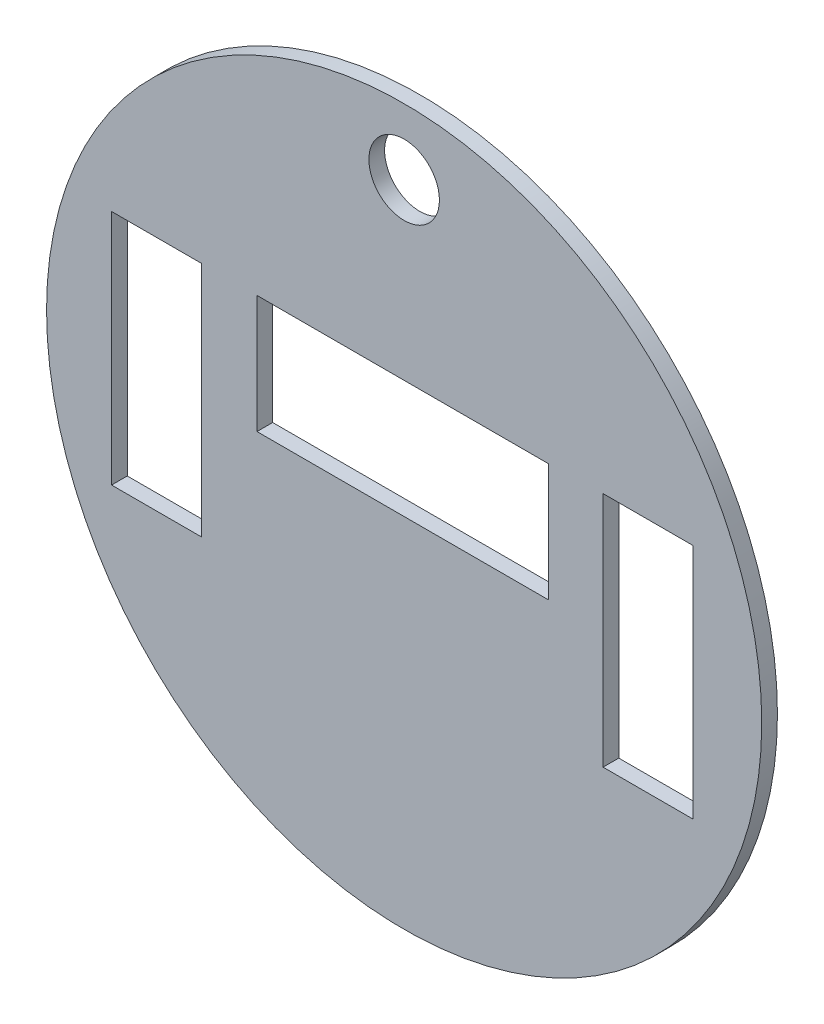
ISO-10303-21;
HEADER;
FILE_DESCRIPTION(('STEP AP214'),'2;1');
FILE_NAME('part.step','',(''),(''),'','','');
FILE_SCHEMA(('AUTOMOTIVE_DESIGN { 1 0 10303 214 1 1 1 1 }'));
ENDSEC;
DATA;
#1=APPLICATION_CONTEXT('core data for automotive mechanical design processes');
#2=APPLICATION_PROTOCOL_DEFINITION('international standard','automotive_design',2000,#1);
#3=PRODUCT_CONTEXT('',#1,'mechanical');
#4=PRODUCT('Part','Part','',(#3));
#5=PRODUCT_RELATED_PRODUCT_CATEGORY('part','',(#4));
#6=PRODUCT_DEFINITION_FORMATION('','',#4);
#7=PRODUCT_DEFINITION_CONTEXT('part definition',#1,'design');
#8=PRODUCT_DEFINITION('design','',#6,#7);
#9=PRODUCT_DEFINITION_SHAPE('','',#8);
#10=(LENGTH_UNIT() NAMED_UNIT(*) SI_UNIT(.MILLI.,.METRE.));
#11=(NAMED_UNIT(*) PLANE_ANGLE_UNIT() SI_UNIT($,.RADIAN.));
#12=(NAMED_UNIT(*) SI_UNIT($,.STERADIAN.) SOLID_ANGLE_UNIT());
#13=UNCERTAINTY_MEASURE_WITH_UNIT(LENGTH_MEASURE(1.E-05),#10,'distance_accuracy_value','');
#14=(GEOMETRIC_REPRESENTATION_CONTEXT(3) GLOBAL_UNCERTAINTY_ASSIGNED_CONTEXT((#13)) GLOBAL_UNIT_ASSIGNED_CONTEXT((#10,
#11,#12)) REPRESENTATION_CONTEXT('',''));
#15=CARTESIAN_POINT('',(0.,0.,0.));
#16=DIRECTION('',(0.,0.,1.));
#17=DIRECTION('',(1.,0.,0.));
#18=AXIS2_PLACEMENT_3D('',#15,#16,#17);
#19=CARTESIAN_POINT('',(0.,0.,13.716));
#20=DIRECTION('',(0.,0.,1.));
#21=DIRECTION('',(1.,0.,0.));
#22=AXIS2_PLACEMENT_3D('',#19,#20,#21);
#23=PLANE('',#22);
#24=DIRECTION('',(1.,0.,0.));
#25=VECTOR('',#24,1.);
#26=CARTESIAN_POINT('',(-128.606579548034,0.,13.716));
#27=LINE('',#26,#25);
#28=CARTESIAN_POINT('',(-128.606579548034,0.,13.716));
#29=VERTEX_POINT('',#28);
#30=CARTESIAN_POINT('',(126.181319760796,0.,13.716));
#31=VERTEX_POINT('',#30);
#32=EDGE_CURVE('E133',#29,#31,#27,.T.);
#33=ORIENTED_EDGE('',*,*,#32,.F.);
#34=DIRECTION('',(0.,-1.,0.));
#35=VECTOR('',#34,1.);
#36=CARTESIAN_POINT('',(-128.606579548034,103.031623715212,13.716));
#37=LINE('',#36,#35);
#38=CARTESIAN_POINT('',(-128.606579548034,103.031623715212,13.716));
#39=VERTEX_POINT('',#38);
#40=EDGE_CURVE('E125',#39,#29,#37,.T.);
#41=ORIENTED_EDGE('',*,*,#40,.F.);
#42=DIRECTION('',(-1.,0.,0.));
#43=VECTOR('',#42,1.);
#44=CARTESIAN_POINT('',(-128.606579548034,103.031623715212,13.716));
#45=LINE('',#44,#43);
#46=CARTESIAN_POINT('',(126.181319760796,103.031623715212,13.716));
#47=VERTEX_POINT('',#46);
#48=EDGE_CURVE('E148',#47,#39,#45,.T.);
#49=ORIENTED_EDGE('',*,*,#48,.F.);
#50=DIRECTION('',(0.,1.,0.));
#51=VECTOR('',#50,1.);
#52=CARTESIAN_POINT('',(126.181319760796,103.031623715212,13.716));
#53=LINE('',#52,#51);
#54=EDGE_CURVE('E146',#31,#47,#53,.T.);
#55=ORIENTED_EDGE('',*,*,#54,.F.);
#56=EDGE_LOOP('',(#33,#41,#49,#55));
#57=FACE_BOUND('',#56,.T.);
#58=DIRECTION('',(1.,0.,0.));
#59=VECTOR('',#58,1.);
#60=CARTESIAN_POINT('',(173.827147679521,-102.752480642791,13.716));
#61=LINE('',#60,#59);
#62=CARTESIAN_POINT('',(173.827147679521,-102.752480642791,13.716));
#63=VERTEX_POINT('',#62);
#64=CARTESIAN_POINT('',(252.607306533598,-102.752480642791,13.716));
#65=VERTEX_POINT('',#64);
#66=EDGE_CURVE('E166',#63,#65,#61,.T.);
#67=ORIENTED_EDGE('',*,*,#66,.F.);
#68=DIRECTION('',(0.,-1.,0.));
#69=VECTOR('',#68,1.);
#70=CARTESIAN_POINT('',(173.827147679521,104.280913681658,13.716));
#71=LINE('',#70,#69);
#72=CARTESIAN_POINT('',(173.827147679521,104.280913681658,13.716));
#73=VERTEX_POINT('',#72);
#74=EDGE_CURVE('E164',#73,#63,#71,.T.);
#75=ORIENTED_EDGE('',*,*,#74,.F.);
#76=DIRECTION('',(-1.,0.,0.));
#77=VECTOR('',#76,1.);
#78=CARTESIAN_POINT('',(173.827147679521,104.280913681658,13.716));
#79=LINE('',#78,#77);
#80=CARTESIAN_POINT('',(252.607306533598,104.280913681658,13.716));
#81=VERTEX_POINT('',#80);
#82=EDGE_CURVE('E172',#81,#73,#79,.T.);
#83=ORIENTED_EDGE('',*,*,#82,.F.);
#84=DIRECTION('',(0.,1.,0.));
#85=VECTOR('',#84,1.);
#86=CARTESIAN_POINT('',(252.607306533598,104.280913681658,13.716));
#87=LINE('',#86,#85);
#88=EDGE_CURVE('E169',#65,#81,#87,.T.);
#89=ORIENTED_EDGE('',*,*,#88,.F.);
#90=EDGE_LOOP('',(#67,#75,#83,#89));
#91=FACE_BOUND('',#90,.T.);
#92=DIRECTION('',(1.,0.,0.));
#93=VECTOR('',#92,1.);
#94=CARTESIAN_POINT('',(-255.668030439342,-104.001770609237,13.716));
#95=LINE('',#94,#93);
#96=CARTESIAN_POINT('',(-255.668030439342,-104.001770609237,13.716));
#97=VERTEX_POINT('',#96);
#98=CARTESIAN_POINT('',(-176.887871585265,-104.001770609237,13.716));
#99=VERTEX_POINT('',#98);
#100=EDGE_CURVE('E197',#97,#99,#95,.T.);
#101=ORIENTED_EDGE('',*,*,#100,.F.);
#102=DIRECTION('',(0.,-1.,0.));
#103=VECTOR('',#102,1.);
#104=CARTESIAN_POINT('',(-255.668030439342,103.031623715212,13.716));
#105=LINE('',#104,#103);
#106=CARTESIAN_POINT('',(-255.668030439342,103.031623715212,13.716));
#107=VERTEX_POINT('',#106);
#108=EDGE_CURVE('E195',#107,#97,#105,.T.);
#109=ORIENTED_EDGE('',*,*,#108,.F.);
#110=DIRECTION('',(-1.,0.,0.));
#111=VECTOR('',#110,1.);
#112=CARTESIAN_POINT('',(-255.668030439342,103.031623715212,13.716));
#113=LINE('',#112,#111);
#114=CARTESIAN_POINT('',(-176.887871585265,103.031623715212,13.716));
#115=VERTEX_POINT('',#114);
#116=EDGE_CURVE('E203',#115,#107,#113,.T.);
#117=ORIENTED_EDGE('',*,*,#116,.F.);
#118=DIRECTION('',(0.,1.,0.));
#119=VECTOR('',#118,1.);
#120=CARTESIAN_POINT('',(-176.887871585265,103.031623715212,13.716));
#121=LINE('',#120,#119);
#122=EDGE_CURVE('E200',#99,#115,#121,.T.);
#123=ORIENTED_EDGE('',*,*,#122,.F.);
#124=EDGE_LOOP('',(#101,#109,#117,#123));
#125=FACE_BOUND('',#124,.T.);
#126=CARTESIAN_POINT('',(0.,0.,13.716));
#127=DIRECTION('',(0.,0.,1.));
#128=DIRECTION('',(1.,0.,0.));
#129=AXIS2_PLACEMENT_3D('',#126,#127,#128);
#130=CIRCLE('',#129,312.497780415951);
#131=CARTESIAN_POINT('',(312.497780415951,0.,13.716));
#132=VERTEX_POINT('',#131);
#133=EDGE_CURVE('E11',#132,#132,#130,.T.);
#134=ORIENTED_EDGE('',*,*,#133,.T.);
#135=EDGE_LOOP('',(#134));
#136=FACE_BOUND('',#135,.T.);
#137=CARTESIAN_POINT('',(0.,254.843469113663,13.716));
#138=DIRECTION('',(0.,0.,1.));
#139=DIRECTION('',(1.,0.,0.));
#140=AXIS2_PLACEMENT_3D('',#137,#138,#139);
#141=CIRCLE('',#140,30.8150821761828);
#142=CARTESIAN_POINT('',(30.8150821761828,254.843469113663,13.716));
#143=VERTEX_POINT('',#142);
#144=EDGE_CURVE('E154',#143,#143,#141,.T.);
#145=ORIENTED_EDGE('',*,*,#144,.F.);
#146=EDGE_LOOP('',(#145));
#147=FACE_BOUND('',#146,.T.);
#148=ADVANCED_FACE('F36',(#57,#91,#125,#136,#147),#23,.T.);
#149=CARTESIAN_POINT('',(0.,0.,0.));
#150=DIRECTION('',(0.,0.,1.));
#151=DIRECTION('',(1.,0.,0.));
#152=AXIS2_PLACEMENT_3D('',#149,#150,#151);
#153=PLANE('',#152);
#154=DIRECTION('',(0.,-1.,0.));
#155=VECTOR('',#154,1.);
#156=CARTESIAN_POINT('',(173.827147679521,104.280913681658,0.));
#157=LINE('',#156,#155);
#158=CARTESIAN_POINT('',(173.827147679521,104.280913681658,0.));
#159=VERTEX_POINT('',#158);
#160=CARTESIAN_POINT('',(173.827147679521,-102.752480642791,0.));
#161=VERTEX_POINT('',#160);
#162=EDGE_CURVE('E141',#159,#161,#157,.T.);
#163=ORIENTED_EDGE('',*,*,#162,.T.);
#164=DIRECTION('',(1.,0.,0.));
#165=VECTOR('',#164,1.);
#166=CARTESIAN_POINT('',(173.827147679521,-102.752480642791,0.));
#167=LINE('',#166,#165);
#168=CARTESIAN_POINT('',(252.607306533598,-102.752480642791,0.));
#169=VERTEX_POINT('',#168);
#170=EDGE_CURVE('E177',#161,#169,#167,.T.);
#171=ORIENTED_EDGE('',*,*,#170,.T.);
#172=DIRECTION('',(0.,1.,0.));
#173=VECTOR('',#172,1.);
#174=CARTESIAN_POINT('',(252.607306533598,104.280913681658,0.));
#175=LINE('',#174,#173);
#176=CARTESIAN_POINT('',(252.607306533598,104.280913681658,0.));
#177=VERTEX_POINT('',#176);
#178=EDGE_CURVE('E180',#169,#177,#175,.T.);
#179=ORIENTED_EDGE('',*,*,#178,.T.);
#180=DIRECTION('',(-1.,0.,0.));
#181=VECTOR('',#180,1.);
#182=CARTESIAN_POINT('',(173.827147679521,104.280913681658,0.));
#183=LINE('',#182,#181);
#184=EDGE_CURVE('E167',#177,#159,#183,.T.);
#185=ORIENTED_EDGE('',*,*,#184,.T.);
#186=EDGE_LOOP('',(#163,#171,#179,#185));
#187=FACE_BOUND('',#186,.T.);
#188=CARTESIAN_POINT('',(0.,0.,0.));
#189=DIRECTION('',(0.,0.,1.));
#190=DIRECTION('',(1.,0.,0.));
#191=AXIS2_PLACEMENT_3D('',#188,#189,#190);
#192=CIRCLE('',#191,312.497780415951);
#193=CARTESIAN_POINT('',(312.497780415951,0.,0.));
#194=VERTEX_POINT('',#193);
#195=EDGE_CURVE('E40',#194,#194,#192,.T.);
#196=ORIENTED_EDGE('',*,*,#195,.F.);
#197=EDGE_LOOP('',(#196));
#198=FACE_BOUND('',#197,.T.);
#199=DIRECTION('',(0.,-1.,0.));
#200=VECTOR('',#199,1.);
#201=CARTESIAN_POINT('',(-255.668030439342,103.031623715212,0.));
#202=LINE('',#201,#200);
#203=CARTESIAN_POINT('',(-255.668030439342,103.031623715212,0.));
#204=VERTEX_POINT('',#203);
#205=CARTESIAN_POINT('',(-255.668030439342,-104.001770609237,0.));
#206=VERTEX_POINT('',#205);
#207=EDGE_CURVE('E194',#204,#206,#202,.T.);
#208=ORIENTED_EDGE('',*,*,#207,.T.);
#209=DIRECTION('',(1.,0.,0.));
#210=VECTOR('',#209,1.);
#211=CARTESIAN_POINT('',(-255.668030439342,-104.001770609237,0.));
#212=LINE('',#211,#210);
#213=CARTESIAN_POINT('',(-176.887871585265,-104.001770609237,0.));
#214=VERTEX_POINT('',#213);
#215=EDGE_CURVE('E208',#206,#214,#212,.T.);
#216=ORIENTED_EDGE('',*,*,#215,.T.);
#217=DIRECTION('',(0.,1.,0.));
#218=VECTOR('',#217,1.);
#219=CARTESIAN_POINT('',(-176.887871585265,103.031623715212,0.));
#220=LINE('',#219,#218);
#221=CARTESIAN_POINT('',(-176.887871585265,103.031623715212,0.));
#222=VERTEX_POINT('',#221);
#223=EDGE_CURVE('E211',#214,#222,#220,.T.);
#224=ORIENTED_EDGE('',*,*,#223,.T.);
#225=DIRECTION('',(-1.,0.,0.));
#226=VECTOR('',#225,1.);
#227=CARTESIAN_POINT('',(-255.668030439342,103.031623715212,0.));
#228=LINE('',#227,#226);
#229=EDGE_CURVE('E198',#222,#204,#228,.T.);
#230=ORIENTED_EDGE('',*,*,#229,.T.);
#231=EDGE_LOOP('',(#208,#216,#224,#230));
#232=FACE_BOUND('',#231,.T.);
#233=DIRECTION('',(0.,-1.,0.));
#234=VECTOR('',#233,1.);
#235=CARTESIAN_POINT('',(-128.606579548034,103.031623715212,0.));
#236=LINE('',#235,#234);
#237=CARTESIAN_POINT('',(-128.606579548034,103.031623715212,0.));
#238=VERTEX_POINT('',#237);
#239=CARTESIAN_POINT('',(-128.606579548034,0.,0.));
#240=VERTEX_POINT('',#239);
#241=EDGE_CURVE('E59',#238,#240,#236,.T.);
#242=ORIENTED_EDGE('',*,*,#241,.T.);
#243=DIRECTION('',(1.,0.,0.));
#244=VECTOR('',#243,1.);
#245=CARTESIAN_POINT('',(-128.606579548034,0.,0.));
#246=LINE('',#245,#244);
#247=CARTESIAN_POINT('',(126.181319760796,0.,0.));
#248=VERTEX_POINT('',#247);
#249=EDGE_CURVE('E140',#240,#248,#246,.T.);
#250=ORIENTED_EDGE('',*,*,#249,.T.);
#251=DIRECTION('',(0.,1.,0.));
#252=VECTOR('',#251,1.);
#253=CARTESIAN_POINT('',(126.181319760796,103.031623715212,0.));
#254=LINE('',#253,#252);
#255=CARTESIAN_POINT('',(126.181319760796,103.031623715212,0.));
#256=VERTEX_POINT('',#255);
#257=EDGE_CURVE('E156',#248,#256,#254,.T.);
#258=ORIENTED_EDGE('',*,*,#257,.T.);
#259=DIRECTION('',(-1.,0.,0.));
#260=VECTOR('',#259,1.);
#261=CARTESIAN_POINT('',(-128.606579548034,103.031623715212,0.));
#262=LINE('',#261,#260);
#263=EDGE_CURVE('E134',#256,#238,#262,.T.);
#264=ORIENTED_EDGE('',*,*,#263,.T.);
#265=EDGE_LOOP('',(#242,#250,#258,#264));
#266=FACE_BOUND('',#265,.T.);
#267=CARTESIAN_POINT('',(0.,254.843469113663,0.));
#268=DIRECTION('',(0.,0.,1.));
#269=DIRECTION('',(1.,0.,0.));
#270=AXIS2_PLACEMENT_3D('',#267,#268,#269);
#271=CIRCLE('',#270,30.8150821761828);
#272=CARTESIAN_POINT('',(30.8150821761828,254.843469113663,0.));
#273=VERTEX_POINT('',#272);
#274=EDGE_CURVE('E238',#273,#273,#271,.T.);
#275=ORIENTED_EDGE('',*,*,#274,.T.);
#276=EDGE_LOOP('',(#275));
#277=FACE_BOUND('',#276,.T.);
#278=ADVANCED_FACE('F230',(#187,#198,#232,#266,#277),#153,.F.);
#279=CARTESIAN_POINT('',(0.,0.,13.716));
#280=DIRECTION('',(0.,0.,-1.));
#281=DIRECTION('',(-1.,0.,0.));
#282=AXIS2_PLACEMENT_3D('',#279,#280,#281);
#283=CYLINDRICAL_SURFACE('',#282,312.497780415951);
#284=ORIENTED_EDGE('',*,*,#133,.F.);
#285=EDGE_LOOP('',(#284));
#286=FACE_BOUND('',#285,.T.);
#287=ORIENTED_EDGE('',*,*,#195,.T.);
#288=EDGE_LOOP('',(#287));
#289=FACE_BOUND('',#288,.T.);
#290=ADVANCED_FACE('F38',(#286,#289),#283,.T.);
#291=CARTESIAN_POINT('',(-255.668030439342,103.031623715212,13.716));
#292=DIRECTION('',(1.,0.,0.));
#293=DIRECTION('',(0.,0.,-1.));
#294=AXIS2_PLACEMENT_3D('',#291,#292,#293);
#295=PLANE('',#294);
#296=ORIENTED_EDGE('',*,*,#207,.F.);
#297=DIRECTION('',(0.,0.,-1.));
#298=VECTOR('',#297,1.);
#299=CARTESIAN_POINT('',(-255.668030439342,103.031623715212,13.716));
#300=LINE('',#299,#298);
#301=EDGE_CURVE('E205',#107,#204,#300,.T.);
#302=ORIENTED_EDGE('',*,*,#301,.F.);
#303=ORIENTED_EDGE('',*,*,#108,.T.);
#304=DIRECTION('',(0.,0.,-1.));
#305=VECTOR('',#304,1.);
#306=CARTESIAN_POINT('',(-255.668030439342,-104.001770609237,13.716));
#307=LINE('',#306,#305);
#308=EDGE_CURVE('E222',#97,#206,#307,.T.);
#309=ORIENTED_EDGE('',*,*,#308,.T.);
#310=EDGE_LOOP('',(#296,#302,#303,#309));
#311=FACE_BOUND('',#310,.T.);
#312=ADVANCED_FACE('F251',(#311),#295,.T.);
#313=CARTESIAN_POINT('',(-255.668030439342,-104.001770609237,13.716));
#314=DIRECTION('',(0.,1.,0.));
#315=DIRECTION('',(0.,0.,1.));
#316=AXIS2_PLACEMENT_3D('',#313,#314,#315);
#317=PLANE('',#316);
#318=ORIENTED_EDGE('',*,*,#215,.F.);
#319=ORIENTED_EDGE('',*,*,#308,.F.);
#320=ORIENTED_EDGE('',*,*,#100,.T.);
#321=DIRECTION('',(0.,0.,-1.));
#322=VECTOR('',#321,1.);
#323=CARTESIAN_POINT('',(-176.887871585265,-104.001770609237,13.716));
#324=LINE('',#323,#322);
#325=EDGE_CURVE('E220',#99,#214,#324,.T.);
#326=ORIENTED_EDGE('',*,*,#325,.T.);
#327=EDGE_LOOP('',(#318,#319,#320,#326));
#328=FACE_BOUND('',#327,.T.);
#329=ADVANCED_FACE('F254',(#328),#317,.T.);
#330=CARTESIAN_POINT('',(-176.887871585265,103.031623715212,13.716));
#331=DIRECTION('',(-1.,0.,0.));
#332=DIRECTION('',(0.,0.,1.));
#333=AXIS2_PLACEMENT_3D('',#330,#331,#332);
#334=PLANE('',#333);
#335=ORIENTED_EDGE('',*,*,#223,.F.);
#336=ORIENTED_EDGE('',*,*,#325,.F.);
#337=ORIENTED_EDGE('',*,*,#122,.T.);
#338=DIRECTION('',(0.,0.,-1.));
#339=VECTOR('',#338,1.);
#340=CARTESIAN_POINT('',(-176.887871585265,103.031623715212,13.716));
#341=LINE('',#340,#339);
#342=EDGE_CURVE('E218',#115,#222,#341,.T.);
#343=ORIENTED_EDGE('',*,*,#342,.T.);
#344=EDGE_LOOP('',(#335,#336,#337,#343));
#345=FACE_BOUND('',#344,.T.);
#346=ADVANCED_FACE('F257',(#345),#334,.T.);
#347=CARTESIAN_POINT('',(-255.668030439342,103.031623715212,13.716));
#348=DIRECTION('',(0.,-1.,0.));
#349=DIRECTION('',(0.,0.,-1.));
#350=AXIS2_PLACEMENT_3D('',#347,#348,#349);
#351=PLANE('',#350);
#352=ORIENTED_EDGE('',*,*,#229,.F.);
#353=ORIENTED_EDGE('',*,*,#342,.F.);
#354=ORIENTED_EDGE('',*,*,#116,.T.);
#355=ORIENTED_EDGE('',*,*,#301,.T.);
#356=EDGE_LOOP('',(#352,#353,#354,#355));
#357=FACE_BOUND('',#356,.T.);
#358=ADVANCED_FACE('F261',(#357),#351,.T.);
#359=CARTESIAN_POINT('',(173.827147679521,104.280913681658,13.716));
#360=DIRECTION('',(1.,0.,0.));
#361=DIRECTION('',(0.,1.,0.));
#362=AXIS2_PLACEMENT_3D('',#359,#360,#361);
#363=PLANE('',#362);
#364=ORIENTED_EDGE('',*,*,#162,.F.);
#365=DIRECTION('',(0.,0.,-1.));
#366=VECTOR('',#365,1.);
#367=CARTESIAN_POINT('',(173.827147679521,104.280913681658,13.716));
#368=LINE('',#367,#366);
#369=EDGE_CURVE('E174',#73,#159,#368,.T.);
#370=ORIENTED_EDGE('',*,*,#369,.F.);
#371=ORIENTED_EDGE('',*,*,#74,.T.);
#372=DIRECTION('',(0.,0.,-1.));
#373=VECTOR('',#372,1.);
#374=CARTESIAN_POINT('',(173.827147679521,-102.752480642791,13.716));
#375=LINE('',#374,#373);
#376=EDGE_CURVE('E191',#63,#161,#375,.T.);
#377=ORIENTED_EDGE('',*,*,#376,.T.);
#378=EDGE_LOOP('',(#364,#370,#371,#377));
#379=FACE_BOUND('',#378,.T.);
#380=ADVANCED_FACE('F265',(#379),#363,.T.);
#381=CARTESIAN_POINT('',(173.827147679521,-102.752480642791,13.716));
#382=DIRECTION('',(0.,1.,0.));
#383=DIRECTION('',(0.,0.,1.));
#384=AXIS2_PLACEMENT_3D('',#381,#382,#383);
#385=PLANE('',#384);
#386=ORIENTED_EDGE('',*,*,#170,.F.);
#387=ORIENTED_EDGE('',*,*,#376,.F.);
#388=ORIENTED_EDGE('',*,*,#66,.T.);
#389=DIRECTION('',(0.,0.,-1.));
#390=VECTOR('',#389,1.);
#391=CARTESIAN_POINT('',(252.607306533598,-102.752480642791,13.716));
#392=LINE('',#391,#390);
#393=EDGE_CURVE('E189',#65,#169,#392,.T.);
#394=ORIENTED_EDGE('',*,*,#393,.T.);
#395=EDGE_LOOP('',(#386,#387,#388,#394));
#396=FACE_BOUND('',#395,.T.);
#397=ADVANCED_FACE('F269',(#396),#385,.T.);
#398=CARTESIAN_POINT('',(252.607306533598,104.280913681658,13.716));
#399=DIRECTION('',(-1.,0.,0.));
#400=DIRECTION('',(0.,0.,1.));
#401=AXIS2_PLACEMENT_3D('',#398,#399,#400);
#402=PLANE('',#401);
#403=ORIENTED_EDGE('',*,*,#178,.F.);
#404=ORIENTED_EDGE('',*,*,#393,.F.);
#405=ORIENTED_EDGE('',*,*,#88,.T.);
#406=DIRECTION('',(0.,0.,-1.));
#407=VECTOR('',#406,1.);
#408=CARTESIAN_POINT('',(252.607306533598,104.280913681658,13.716));
#409=LINE('',#408,#407);
#410=EDGE_CURVE('E187',#81,#177,#409,.T.);
#411=ORIENTED_EDGE('',*,*,#410,.T.);
#412=EDGE_LOOP('',(#403,#404,#405,#411));
#413=FACE_BOUND('',#412,.T.);
#414=ADVANCED_FACE('F273',(#413),#402,.T.);
#415=CARTESIAN_POINT('',(173.827147679521,104.280913681658,13.716));
#416=DIRECTION('',(0.,-1.,0.));
#417=DIRECTION('',(0.,0.,-1.));
#418=AXIS2_PLACEMENT_3D('',#415,#416,#417);
#419=PLANE('',#418);
#420=ORIENTED_EDGE('',*,*,#184,.F.);
#421=ORIENTED_EDGE('',*,*,#410,.F.);
#422=ORIENTED_EDGE('',*,*,#82,.T.);
#423=ORIENTED_EDGE('',*,*,#369,.T.);
#424=EDGE_LOOP('',(#420,#421,#422,#423));
#425=FACE_BOUND('',#424,.T.);
#426=ADVANCED_FACE('F277',(#425),#419,.T.);
#427=CARTESIAN_POINT('',(-128.606579548034,103.031623715212,13.716));
#428=DIRECTION('',(1.,0.,0.));
#429=DIRECTION('',(0.,0.,-1.));
#430=AXIS2_PLACEMENT_3D('',#427,#428,#429);
#431=PLANE('',#430);
#432=ORIENTED_EDGE('',*,*,#241,.F.);
#433=DIRECTION('',(0.,0.,-1.));
#434=VECTOR('',#433,1.);
#435=CARTESIAN_POINT('',(-128.606579548034,103.031623715212,13.716));
#436=LINE('',#435,#434);
#437=EDGE_CURVE('E129',#39,#238,#436,.T.);
#438=ORIENTED_EDGE('',*,*,#437,.F.);
#439=ORIENTED_EDGE('',*,*,#40,.T.);
#440=DIRECTION('',(0.,0.,-1.));
#441=VECTOR('',#440,1.);
#442=CARTESIAN_POINT('',(-128.606579548034,0.,13.716));
#443=LINE('',#442,#441);
#444=EDGE_CURVE('E128',#29,#240,#443,.T.);
#445=ORIENTED_EDGE('',*,*,#444,.T.);
#446=EDGE_LOOP('',(#432,#438,#439,#445));
#447=FACE_BOUND('',#446,.T.);
#448=ADVANCED_FACE('F127',(#447),#431,.T.);
#449=CARTESIAN_POINT('',(-128.606579548034,0.,13.716));
#450=DIRECTION('',(0.,1.,0.));
#451=DIRECTION('',(0.,0.,1.));
#452=AXIS2_PLACEMENT_3D('',#449,#450,#451);
#453=PLANE('',#452);
#454=ORIENTED_EDGE('',*,*,#249,.F.);
#455=ORIENTED_EDGE('',*,*,#444,.F.);
#456=ORIENTED_EDGE('',*,*,#32,.T.);
#457=DIRECTION('',(0.,0.,-1.));
#458=VECTOR('',#457,1.);
#459=CARTESIAN_POINT('',(126.181319760796,0.,13.716));
#460=LINE('',#459,#458);
#461=EDGE_CURVE('E142',#31,#248,#460,.T.);
#462=ORIENTED_EDGE('',*,*,#461,.T.);
#463=EDGE_LOOP('',(#454,#455,#456,#462));
#464=FACE_BOUND('',#463,.T.);
#465=ADVANCED_FACE('F137',(#464),#453,.T.);
#466=CARTESIAN_POINT('',(126.181319760796,103.031623715212,13.716));
#467=DIRECTION('',(-1.,0.,0.));
#468=DIRECTION('',(0.,0.,1.));
#469=AXIS2_PLACEMENT_3D('',#466,#467,#468);
#470=PLANE('',#469);
#471=ORIENTED_EDGE('',*,*,#257,.F.);
#472=ORIENTED_EDGE('',*,*,#461,.F.);
#473=ORIENTED_EDGE('',*,*,#54,.T.);
#474=DIRECTION('',(0.,0.,-1.));
#475=VECTOR('',#474,1.);
#476=CARTESIAN_POINT('',(126.181319760796,103.031623715212,13.716));
#477=LINE('',#476,#475);
#478=EDGE_CURVE('E51',#47,#256,#477,.T.);
#479=ORIENTED_EDGE('',*,*,#478,.T.);
#480=EDGE_LOOP('',(#471,#472,#473,#479));
#481=FACE_BOUND('',#480,.T.);
#482=ADVANCED_FACE('F286',(#481),#470,.T.);
#483=CARTESIAN_POINT('',(-128.606579548034,103.031623715212,13.716));
#484=DIRECTION('',(0.,-1.,0.));
#485=DIRECTION('',(0.,0.,-1.));
#486=AXIS2_PLACEMENT_3D('',#483,#484,#485);
#487=PLANE('',#486);
#488=ORIENTED_EDGE('',*,*,#263,.F.);
#489=ORIENTED_EDGE('',*,*,#478,.F.);
#490=ORIENTED_EDGE('',*,*,#48,.T.);
#491=ORIENTED_EDGE('',*,*,#437,.T.);
#492=EDGE_LOOP('',(#488,#489,#490,#491));
#493=FACE_BOUND('',#492,.T.);
#494=ADVANCED_FACE('F289',(#493),#487,.T.);
#495=CARTESIAN_POINT('',(0.,254.843469113663,13.716));
#496=DIRECTION('',(0.,0.,-1.));
#497=DIRECTION('',(-1.,0.,0.));
#498=AXIS2_PLACEMENT_3D('',#495,#496,#497);
#499=CYLINDRICAL_SURFACE('',#498,30.8150821761828);
#500=ORIENTED_EDGE('',*,*,#144,.T.);
#501=EDGE_LOOP('',(#500));
#502=FACE_BOUND('',#501,.T.);
#503=ORIENTED_EDGE('',*,*,#274,.F.);
#504=EDGE_LOOP('',(#503));
#505=FACE_BOUND('',#504,.T.);
#506=ADVANCED_FACE('F244',(#502,#505),#499,.F.);
#507=CLOSED_SHELL('',(#148,#278,#290,#312,#329,#346,#358,#380,#397,#414,#426,#448,#465,#482,
#494,#506));
#508=MANIFOLD_SOLID_BREP('B2',#507);
#509=ADVANCED_BREP_SHAPE_REPRESENTATION('',(#18,#508),#14);
#510=SHAPE_DEFINITION_REPRESENTATION(#9,#509);
ENDSEC;
END-ISO-10303-21;
